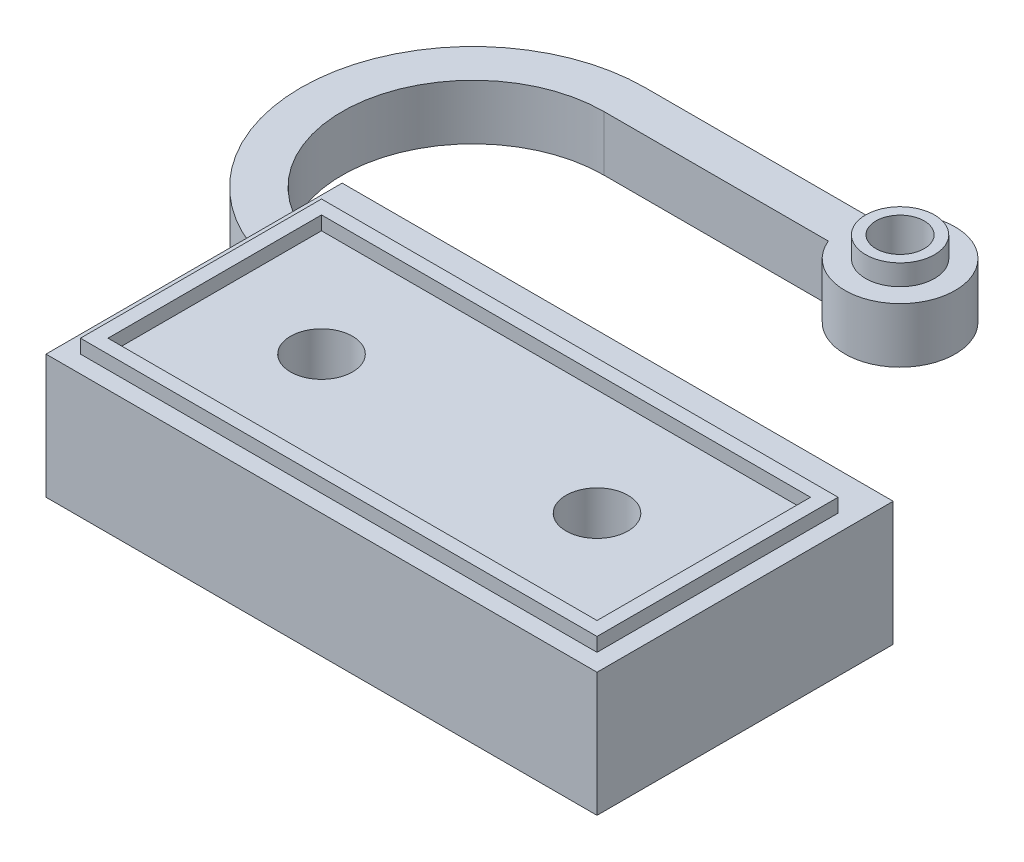
ISO-10303-21;
HEADER;
FILE_DESCRIPTION(('STEP AP214'),'2;1');
FILE_NAME('part.step','',(''),(''),'','','');
FILE_SCHEMA(('AUTOMOTIVE_DESIGN { 1 0 10303 214 1 1 1 1 }'));
ENDSEC;
DATA;
#1=APPLICATION_CONTEXT('core data for automotive mechanical design processes');
#2=APPLICATION_PROTOCOL_DEFINITION('international standard','automotive_design',2000,#1);
#3=PRODUCT_CONTEXT('',#1,'mechanical');
#4=PRODUCT('Part','Part','',(#3));
#5=PRODUCT_RELATED_PRODUCT_CATEGORY('part','',(#4));
#6=PRODUCT_DEFINITION_FORMATION('','',#4);
#7=PRODUCT_DEFINITION_CONTEXT('part definition',#1,'design');
#8=PRODUCT_DEFINITION('design','',#6,#7);
#9=PRODUCT_DEFINITION_SHAPE('','',#8);
#10=(LENGTH_UNIT() NAMED_UNIT(*) SI_UNIT(.MILLI.,.METRE.));
#11=(NAMED_UNIT(*) PLANE_ANGLE_UNIT() SI_UNIT($,.RADIAN.));
#12=(NAMED_UNIT(*) SI_UNIT($,.STERADIAN.) SOLID_ANGLE_UNIT());
#13=UNCERTAINTY_MEASURE_WITH_UNIT(LENGTH_MEASURE(1.E-05),#10,'distance_accuracy_value','');
#14=(GEOMETRIC_REPRESENTATION_CONTEXT(3) GLOBAL_UNCERTAINTY_ASSIGNED_CONTEXT((#13)) GLOBAL_UNIT_ASSIGNED_CONTEXT((#10,
#11,#12)) REPRESENTATION_CONTEXT('',''));
#15=CARTESIAN_POINT('',(0.,0.,0.));
#16=DIRECTION('',(0.,0.,1.));
#17=DIRECTION('',(1.,0.,0.));
#18=AXIS2_PLACEMENT_3D('',#15,#16,#17);
#19=CARTESIAN_POINT('',(0.,9.,0.));
#20=DIRECTION('',(0.,1.,0.));
#21=DIRECTION('',(0.,0.,1.));
#22=AXIS2_PLACEMENT_3D('',#19,#20,#21);
#23=PLANE('',#22);
#24=DIRECTION('',(0.,0.,1.));
#25=VECTOR('',#24,1.);
#26=CARTESIAN_POINT('',(20.,9.,0.));
#27=LINE('',#26,#25);
#28=CARTESIAN_POINT('',(20.,9.,-11.5));
#29=VERTEX_POINT('',#28);
#30=CARTESIAN_POINT('',(20.,9.,10.));
#31=VERTEX_POINT('',#30);
#32=EDGE_CURVE('E306',#29,#31,#27,.T.);
#33=ORIENTED_EDGE('',*,*,#32,.F.);
#34=DIRECTION('',(-1.,0.,0.));
#35=VECTOR('',#34,1.);
#36=CARTESIAN_POINT('',(0.,9.,-11.5));
#37=LINE('',#36,#35);
#38=CARTESIAN_POINT('',(-19.9999999999999,9.,-11.5));
#39=VERTEX_POINT('',#38);
#40=EDGE_CURVE('E309',#29,#39,#37,.T.);
#41=ORIENTED_EDGE('',*,*,#40,.T.);
#42=DIRECTION('',(0.,0.,1.));
#43=VECTOR('',#42,1.);
#44=CARTESIAN_POINT('',(-20.0000000000001,9.,2.98372437868013E-13));
#45=LINE('',#44,#43);
#46=CARTESIAN_POINT('',(-20.,9.,10.));
#47=VERTEX_POINT('',#46);
#48=EDGE_CURVE('E312',#39,#47,#45,.T.);
#49=ORIENTED_EDGE('',*,*,#48,.T.);
#50=DIRECTION('',(1.,0.,0.));
#51=VECTOR('',#50,1.);
#52=CARTESIAN_POINT('',(0.,9.,10.));
#53=LINE('',#52,#51);
#54=EDGE_CURVE('E314',#47,#31,#53,.T.);
#55=ORIENTED_EDGE('',*,*,#54,.T.);
#56=EDGE_LOOP('',(#33,#41,#49,#55));
#57=FACE_BOUND('',#56,.T.);
#58=DIRECTION('',(1.,0.,0.));
#59=VECTOR('',#58,1.);
#60=CARTESIAN_POINT('',(-18.75,9.,8.75));
#61=LINE('',#60,#59);
#62=CARTESIAN_POINT('',(-18.75,9.,8.75));
#63=VERTEX_POINT('',#62);
#64=CARTESIAN_POINT('',(18.75,9.,8.75));
#65=VERTEX_POINT('',#64);
#66=EDGE_CURVE('E74',#63,#65,#61,.T.);
#67=ORIENTED_EDGE('',*,*,#66,.F.);
#68=DIRECTION('',(0.,0.,1.));
#69=VECTOR('',#68,1.);
#70=CARTESIAN_POINT('',(-18.75,9.,-8.75));
#71=LINE('',#70,#69);
#72=CARTESIAN_POINT('',(-18.75,9.,-8.75));
#73=VERTEX_POINT('',#72);
#74=EDGE_CURVE('E200',#73,#63,#71,.T.);
#75=ORIENTED_EDGE('',*,*,#74,.F.);
#76=DIRECTION('',(1.,0.,0.));
#77=VECTOR('',#76,1.);
#78=CARTESIAN_POINT('',(-18.75,9.,-8.75));
#79=LINE('',#78,#77);
#80=CARTESIAN_POINT('',(18.75,9.,-8.75));
#81=VERTEX_POINT('',#80);
#82=EDGE_CURVE('E226',#73,#81,#79,.T.);
#83=ORIENTED_EDGE('',*,*,#82,.T.);
#84=DIRECTION('',(0.,0.,1.));
#85=VECTOR('',#84,1.);
#86=CARTESIAN_POINT('',(18.75,9.,-8.75));
#87=LINE('',#86,#85);
#88=EDGE_CURVE('E79',#81,#65,#87,.T.);
#89=ORIENTED_EDGE('',*,*,#88,.T.);
#90=EDGE_LOOP('',(#67,#75,#83,#89));
#91=FACE_BOUND('',#90,.T.);
#92=ADVANCED_FACE('F59',(#57,#91),#23,.T.);
#93=CARTESIAN_POINT('',(0.,4.,0.));
#94=DIRECTION('',(0.,1.,0.));
#95=DIRECTION('',(0.,0.,1.));
#96=AXIS2_PLACEMENT_3D('',#93,#94,#95);
#97=PLANE('',#96);
#98=DIRECTION('',(1.,0.,0.));
#99=VECTOR('',#98,1.);
#100=CARTESIAN_POINT('',(0.,4.,-30.5));
#101=LINE('',#100,#99);
#102=CARTESIAN_POINT('',(-20.,4.,-30.5));
#103=VERTEX_POINT('',#102);
#104=CARTESIAN_POINT('',(-3.70809924354783,4.,-30.5));
#105=VERTEX_POINT('',#104);
#106=EDGE_CURVE('E259',#103,#105,#101,.T.);
#107=ORIENTED_EDGE('',*,*,#106,.T.);
#108=CARTESIAN_POINT('',(0.,4.,-32.));
#109=DIRECTION('',(0.,1.,0.));
#110=DIRECTION('',(0.,0.,1.));
#111=AXIS2_PLACEMENT_3D('',#108,#109,#110);
#112=CIRCLE('',#111,4.);
#113=CARTESIAN_POINT('',(-3.70809924354783,4.,-33.5));
#114=VERTEX_POINT('',#113);
#115=EDGE_CURVE('E262',#105,#114,#112,.T.);
#116=ORIENTED_EDGE('',*,*,#115,.T.);
#117=DIRECTION('',(-1.,0.,0.));
#118=VECTOR('',#117,1.);
#119=CARTESIAN_POINT('',(0.,4.,-33.5));
#120=LINE('',#119,#118);
#121=CARTESIAN_POINT('',(-20.,4.,-33.5));
#122=VERTEX_POINT('',#121);
#123=EDGE_CURVE('E265',#114,#122,#120,.T.);
#124=ORIENTED_EDGE('',*,*,#123,.T.);
#125=CARTESIAN_POINT('',(-20.,4.,-21.));
#126=DIRECTION('',(0.,1.,0.));
#127=DIRECTION('',(0.,0.,1.));
#128=AXIS2_PLACEMENT_3D('',#125,#126,#127);
#129=CIRCLE('',#128,12.5);
#130=CARTESIAN_POINT('',(-20.0000000000003,4.,-8.5));
#131=VERTEX_POINT('',#130);
#132=EDGE_CURVE('E267',#122,#131,#129,.T.);
#133=ORIENTED_EDGE('',*,*,#132,.T.);
#134=DIRECTION('',(0.,0.,1.));
#135=VECTOR('',#134,1.);
#136=CARTESIAN_POINT('',(-20.0000000000001,4.,2.98372437868013E-13));
#137=LINE('',#136,#135);
#138=CARTESIAN_POINT('',(-19.9999999999999,4.,-11.5));
#139=VERTEX_POINT('',#138);
#140=EDGE_CURVE('E270',#139,#131,#137,.T.);
#141=ORIENTED_EDGE('',*,*,#140,.F.);
#142=CARTESIAN_POINT('',(-20.,4.,-21.));
#143=DIRECTION('',(0.,1.,0.));
#144=DIRECTION('',(0.,0.,1.));
#145=AXIS2_PLACEMENT_3D('',#142,#143,#144);
#146=CIRCLE('',#145,9.49999999999999);
#147=EDGE_CURVE('E272',#139,#103,#146,.F.);
#148=ORIENTED_EDGE('',*,*,#147,.T.);
#149=EDGE_LOOP('',(#107,#116,#124,#133,#141,#148));
#150=FACE_BOUND('',#149,.T.);
#151=CARTESIAN_POINT('',(0.,4.,-32.));
#152=DIRECTION('',(0.,1.,0.));
#153=DIRECTION('',(0.,0.,1.));
#154=AXIS2_PLACEMENT_3D('',#151,#152,#153);
#155=CIRCLE('',#154,2.5);
#156=CARTESIAN_POINT('',(0.,4.,-29.5));
#157=VERTEX_POINT('',#156);
#158=EDGE_CURVE('E252',#157,#157,#155,.T.);
#159=ORIENTED_EDGE('',*,*,#158,.F.);
#160=EDGE_LOOP('',(#159));
#161=FACE_BOUND('',#160,.T.);
#162=ADVANCED_FACE('F356',(#150,#161),#97,.T.);
#163=CARTESIAN_POINT('',(-20.0000000000001,9.,2.98372437868013E-13));
#164=DIRECTION('',(1.,0.,0.));
#165=DIRECTION('',(0.,0.,-1.));
#166=AXIS2_PLACEMENT_3D('',#163,#164,#165);
#167=PLANE('',#166);
#168=DIRECTION('',(0.,-1.,0.));
#169=VECTOR('',#168,1.);
#170=CARTESIAN_POINT('',(-20.0000000000003,4.,-8.5));
#171=LINE('',#170,#169);
#172=CARTESIAN_POINT('',(-20.0000000000003,0.,-8.5));
#173=VERTEX_POINT('',#172);
#174=EDGE_CURVE('E293',#131,#173,#171,.T.);
#175=ORIENTED_EDGE('',*,*,#174,.T.);
#176=DIRECTION('',(0.,0.,1.));
#177=VECTOR('',#176,1.);
#178=CARTESIAN_POINT('',(-20.0000000000001,0.,2.98372437868013E-13));
#179=LINE('',#178,#177);
#180=CARTESIAN_POINT('',(-20.,0.,10.));
#181=VERTEX_POINT('',#180);
#182=EDGE_CURVE('E327',#173,#181,#179,.T.);
#183=ORIENTED_EDGE('',*,*,#182,.T.);
#184=DIRECTION('',(0.,-1.,0.));
#185=VECTOR('',#184,1.);
#186=CARTESIAN_POINT('',(-20.,9.,10.));
#187=LINE('',#186,#185);
#188=EDGE_CURVE('E338',#47,#181,#187,.T.);
#189=ORIENTED_EDGE('',*,*,#188,.F.);
#190=ORIENTED_EDGE('',*,*,#48,.F.);
#191=DIRECTION('',(0.,-1.,0.));
#192=VECTOR('',#191,1.);
#193=CARTESIAN_POINT('',(-19.9999999999999,9.,-11.5));
#194=LINE('',#193,#192);
#195=EDGE_CURVE('E67',#39,#139,#194,.T.);
#196=ORIENTED_EDGE('',*,*,#195,.T.);
#197=ORIENTED_EDGE('',*,*,#140,.T.);
#198=EDGE_LOOP('',(#175,#183,#189,#190,#196,#197));
#199=FACE_BOUND('',#198,.T.);
#200=ADVANCED_FACE('F345',(#199),#167,.F.);
#201=CARTESIAN_POINT('',(20.,9.,0.));
#202=DIRECTION('',(1.,0.,0.));
#203=DIRECTION('',(0.,0.,-1.));
#204=AXIS2_PLACEMENT_3D('',#201,#202,#203);
#205=PLANE('',#204);
#206=DIRECTION('',(0.,0.,1.));
#207=VECTOR('',#206,1.);
#208=CARTESIAN_POINT('',(20.,0.,0.));
#209=LINE('',#208,#207);
#210=CARTESIAN_POINT('',(20.,0.,-11.5));
#211=VERTEX_POINT('',#210);
#212=CARTESIAN_POINT('',(20.,0.,10.));
#213=VERTEX_POINT('',#212);
#214=EDGE_CURVE('E305',#211,#213,#209,.T.);
#215=ORIENTED_EDGE('',*,*,#214,.F.);
#216=DIRECTION('',(0.,-1.,0.));
#217=VECTOR('',#216,1.);
#218=CARTESIAN_POINT('',(20.,9.,-11.5));
#219=LINE('',#218,#217);
#220=EDGE_CURVE('E12',#29,#211,#219,.T.);
#221=ORIENTED_EDGE('',*,*,#220,.F.);
#222=ORIENTED_EDGE('',*,*,#32,.T.);
#223=DIRECTION('',(0.,-1.,0.));
#224=VECTOR('',#223,1.);
#225=CARTESIAN_POINT('',(20.,9.,10.));
#226=LINE('',#225,#224);
#227=EDGE_CURVE('E322',#31,#213,#226,.T.);
#228=ORIENTED_EDGE('',*,*,#227,.T.);
#229=EDGE_LOOP('',(#215,#221,#222,#228));
#230=FACE_BOUND('',#229,.T.);
#231=ADVANCED_FACE('F61',(#230),#205,.T.);
#232=CARTESIAN_POINT('',(0.,9.,-11.5));
#233=DIRECTION('',(0.,0.,1.));
#234=DIRECTION('',(1.,0.,0.));
#235=AXIS2_PLACEMENT_3D('',#232,#233,#234);
#236=PLANE('',#235);
#237=DIRECTION('',(-1.,0.,0.));
#238=VECTOR('',#237,1.);
#239=CARTESIAN_POINT('',(0.,0.,-11.5));
#240=LINE('',#239,#238);
#241=CARTESIAN_POINT('',(-19.9999999999999,0.,-11.5));
#242=VERTEX_POINT('',#241);
#243=EDGE_CURVE('E325',#211,#242,#240,.T.);
#244=ORIENTED_EDGE('',*,*,#243,.T.);
#245=DIRECTION('',(0.,-1.,0.));
#246=VECTOR('',#245,1.);
#247=CARTESIAN_POINT('',(-19.9999999999999,4.,-11.5));
#248=LINE('',#247,#246);
#249=EDGE_CURVE('E290',#139,#242,#248,.T.);
#250=ORIENTED_EDGE('',*,*,#249,.F.);
#251=ORIENTED_EDGE('',*,*,#195,.F.);
#252=ORIENTED_EDGE('',*,*,#40,.F.);
#253=ORIENTED_EDGE('',*,*,#220,.T.);
#254=EDGE_LOOP('',(#244,#250,#251,#252,#253));
#255=FACE_BOUND('',#254,.T.);
#256=ADVANCED_FACE('F378',(#255),#236,.F.);
#257=CARTESIAN_POINT('',(-10.,9.,0.));
#258=DIRECTION('',(0.,-1.,0.));
#259=DIRECTION('',(0.,0.,-1.));
#260=AXIS2_PLACEMENT_3D('',#257,#258,#259);
#261=CYLINDRICAL_SURFACE('',#260,2.25);
#262=CARTESIAN_POINT('',(-10.,9.,0.));
#263=DIRECTION('',(0.,1.,0.));
#264=DIRECTION('',(0.,0.,1.));
#265=AXIS2_PLACEMENT_3D('',#262,#263,#264);
#266=CIRCLE('',#265,2.25);
#267=CARTESIAN_POINT('',(-10.,9.,2.25));
#268=VERTEX_POINT('',#267);
#269=EDGE_CURVE('E316',#268,#268,#266,.T.);
#270=ORIENTED_EDGE('',*,*,#269,.T.);
#271=EDGE_LOOP('',(#270));
#272=FACE_BOUND('',#271,.T.);
#273=CARTESIAN_POINT('',(-10.,0.,0.));
#274=DIRECTION('',(0.,1.,0.));
#275=DIRECTION('',(0.,0.,1.));
#276=AXIS2_PLACEMENT_3D('',#273,#274,#275);
#277=CIRCLE('',#276,2.25);
#278=CARTESIAN_POINT('',(-10.,0.,2.25));
#279=VERTEX_POINT('',#278);
#280=EDGE_CURVE('E332',#279,#279,#277,.T.);
#281=ORIENTED_EDGE('',*,*,#280,.F.);
#282=EDGE_LOOP('',(#281));
#283=FACE_BOUND('',#282,.T.);
#284=ADVANCED_FACE('F380',(#272,#283),#261,.F.);
#285=CARTESIAN_POINT('',(0.,9.,10.));
#286=DIRECTION('',(0.,0.,-1.));
#287=DIRECTION('',(-1.,0.,0.));
#288=AXIS2_PLACEMENT_3D('',#285,#286,#287);
#289=PLANE('',#288);
#290=DIRECTION('',(1.,0.,0.));
#291=VECTOR('',#290,1.);
#292=CARTESIAN_POINT('',(0.,0.,10.));
#293=LINE('',#292,#291);
#294=EDGE_CURVE('E329',#181,#213,#293,.T.);
#295=ORIENTED_EDGE('',*,*,#294,.T.);
#296=ORIENTED_EDGE('',*,*,#227,.F.);
#297=ORIENTED_EDGE('',*,*,#54,.F.);
#298=ORIENTED_EDGE('',*,*,#188,.T.);
#299=EDGE_LOOP('',(#295,#296,#297,#298));
#300=FACE_BOUND('',#299,.T.);
#301=ADVANCED_FACE('F369',(#300),#289,.F.);
#302=CARTESIAN_POINT('',(10.,9.,0.));
#303=DIRECTION('',(0.,-1.,0.));
#304=DIRECTION('',(0.,0.,-1.));
#305=AXIS2_PLACEMENT_3D('',#302,#303,#304);
#306=CYLINDRICAL_SURFACE('',#305,2.25);
#307=CARTESIAN_POINT('',(10.,9.,0.));
#308=DIRECTION('',(0.,1.,0.));
#309=DIRECTION('',(0.,0.,1.));
#310=AXIS2_PLACEMENT_3D('',#307,#308,#309);
#311=CIRCLE('',#310,2.25);
#312=CARTESIAN_POINT('',(10.,9.,2.25));
#313=VERTEX_POINT('',#312);
#314=EDGE_CURVE('E319',#313,#313,#311,.F.);
#315=ORIENTED_EDGE('',*,*,#314,.F.);
#316=EDGE_LOOP('',(#315));
#317=FACE_BOUND('',#316,.T.);
#318=CARTESIAN_POINT('',(10.,0.,0.));
#319=DIRECTION('',(0.,1.,0.));
#320=DIRECTION('',(0.,0.,1.));
#321=AXIS2_PLACEMENT_3D('',#318,#319,#320);
#322=CIRCLE('',#321,2.25);
#323=CARTESIAN_POINT('',(10.,0.,2.25));
#324=VERTEX_POINT('',#323);
#325=EDGE_CURVE('E310',#324,#324,#322,.F.);
#326=ORIENTED_EDGE('',*,*,#325,.T.);
#327=EDGE_LOOP('',(#326));
#328=FACE_BOUND('',#327,.T.);
#329=ADVANCED_FACE('F398',(#317,#328),#306,.F.);
#330=DIRECTION('',(1.,0.,0.));
#331=VECTOR('',#330,1.);
#332=CARTESIAN_POINT('',(-17.75,9.,7.75));
#333=LINE('',#332,#331);
#334=CARTESIAN_POINT('',(-17.75,9.,7.75));
#335=VERTEX_POINT('',#334);
#336=CARTESIAN_POINT('',(17.75,9.,7.75));
#337=VERTEX_POINT('',#336);
#338=EDGE_CURVE('E210',#335,#337,#333,.T.);
#339=ORIENTED_EDGE('',*,*,#338,.T.);
#340=DIRECTION('',(0.,0.,1.));
#341=VECTOR('',#340,1.);
#342=CARTESIAN_POINT('',(17.75,9.,-7.75));
#343=LINE('',#342,#341);
#344=CARTESIAN_POINT('',(17.75,9.,-7.75));
#345=VERTEX_POINT('',#344);
#346=EDGE_CURVE('E199',#345,#337,#343,.T.);
#347=ORIENTED_EDGE('',*,*,#346,.F.);
#348=DIRECTION('',(1.,0.,0.));
#349=VECTOR('',#348,1.);
#350=CARTESIAN_POINT('',(-17.75,9.,-7.75));
#351=LINE('',#350,#349);
#352=CARTESIAN_POINT('',(-17.75,9.,-7.75));
#353=VERTEX_POINT('',#352);
#354=EDGE_CURVE('E213',#353,#345,#351,.T.);
#355=ORIENTED_EDGE('',*,*,#354,.F.);
#356=DIRECTION('',(0.,0.,1.));
#357=VECTOR('',#356,1.);
#358=CARTESIAN_POINT('',(-17.75,9.,-7.75));
#359=LINE('',#358,#357);
#360=EDGE_CURVE('E192',#353,#335,#359,.T.);
#361=ORIENTED_EDGE('',*,*,#360,.T.);
#362=EDGE_LOOP('',(#339,#347,#355,#361));
#363=FACE_BOUND('',#362,.T.);
#364=ORIENTED_EDGE('',*,*,#269,.F.);
#365=EDGE_LOOP('',(#364));
#366=FACE_BOUND('',#365,.T.);
#367=ORIENTED_EDGE('',*,*,#314,.T.);
#368=EDGE_LOOP('',(#367));
#369=FACE_BOUND('',#368,.T.);
#370=ADVANCED_FACE('F390',(#363,#366,#369),#23,.T.);
#371=CARTESIAN_POINT('',(0.,0.,0.));
#372=DIRECTION('',(0.,1.,0.));
#373=DIRECTION('',(0.,0.,1.));
#374=AXIS2_PLACEMENT_3D('',#371,#372,#373);
#375=PLANE('',#374);
#376=ORIENTED_EDGE('',*,*,#214,.T.);
#377=ORIENTED_EDGE('',*,*,#294,.F.);
#378=ORIENTED_EDGE('',*,*,#182,.F.);
#379=CARTESIAN_POINT('',(-20.,0.,-21.));
#380=DIRECTION('',(0.,1.,0.));
#381=DIRECTION('',(0.,0.,1.));
#382=AXIS2_PLACEMENT_3D('',#379,#380,#381);
#383=CIRCLE('',#382,12.5);
#384=CARTESIAN_POINT('',(-20.,0.,-33.5));
#385=VERTEX_POINT('',#384);
#386=EDGE_CURVE('E284',#385,#173,#383,.T.);
#387=ORIENTED_EDGE('',*,*,#386,.F.);
#388=DIRECTION('',(-1.,0.,0.));
#389=VECTOR('',#388,1.);
#390=CARTESIAN_POINT('',(0.,0.,-33.5));
#391=LINE('',#390,#389);
#392=CARTESIAN_POINT('',(-3.70809924354783,0.,-33.5));
#393=VERTEX_POINT('',#392);
#394=EDGE_CURVE('E282',#393,#385,#391,.T.);
#395=ORIENTED_EDGE('',*,*,#394,.F.);
#396=CARTESIAN_POINT('',(0.,0.,-32.));
#397=DIRECTION('',(0.,1.,0.));
#398=DIRECTION('',(0.,0.,1.));
#399=AXIS2_PLACEMENT_3D('',#396,#397,#398);
#400=CIRCLE('',#399,4.);
#401=CARTESIAN_POINT('',(-3.70809924354783,0.,-30.5));
#402=VERTEX_POINT('',#401);
#403=EDGE_CURVE('E280',#402,#393,#400,.T.);
#404=ORIENTED_EDGE('',*,*,#403,.F.);
#405=DIRECTION('',(1.,0.,0.));
#406=VECTOR('',#405,1.);
#407=CARTESIAN_POINT('',(0.,0.,-30.5));
#408=LINE('',#407,#406);
#409=CARTESIAN_POINT('',(-20.,0.,-30.5));
#410=VERTEX_POINT('',#409);
#411=EDGE_CURVE('E277',#410,#402,#408,.T.);
#412=ORIENTED_EDGE('',*,*,#411,.F.);
#413=CARTESIAN_POINT('',(-20.,0.,-21.));
#414=DIRECTION('',(0.,1.,0.));
#415=DIRECTION('',(0.,0.,1.));
#416=AXIS2_PLACEMENT_3D('',#413,#414,#415);
#417=CIRCLE('',#416,9.49999999999999);
#418=EDGE_CURVE('E263',#242,#410,#417,.F.);
#419=ORIENTED_EDGE('',*,*,#418,.F.);
#420=ORIENTED_EDGE('',*,*,#243,.F.);
#421=EDGE_LOOP('',(#376,#377,#378,#387,#395,#404,#412,#419,#420));
#422=FACE_BOUND('',#421,.T.);
#423=ORIENTED_EDGE('',*,*,#280,.T.);
#424=EDGE_LOOP('',(#423));
#425=FACE_BOUND('',#424,.T.);
#426=ORIENTED_EDGE('',*,*,#325,.F.);
#427=EDGE_LOOP('',(#426));
#428=FACE_BOUND('',#427,.T.);
#429=CARTESIAN_POINT('',(0.,0.,-32.));
#430=DIRECTION('',(0.,1.,0.));
#431=DIRECTION('',(0.,0.,1.));
#432=AXIS2_PLACEMENT_3D('',#429,#430,#431);
#433=CIRCLE('',#432,1.75);
#434=CARTESIAN_POINT('',(0.,0.,-30.25));
#435=VERTEX_POINT('',#434);
#436=EDGE_CURVE('E256',#435,#435,#433,.T.);
#437=ORIENTED_EDGE('',*,*,#436,.T.);
#438=EDGE_LOOP('',(#437));
#439=FACE_BOUND('',#438,.T.);
#440=ADVANCED_FACE('F371',(#422,#425,#428,#439),#375,.F.);
#441=CARTESIAN_POINT('',(0.,4.,-30.5));
#442=DIRECTION('',(0.,0.,-1.));
#443=DIRECTION('',(-1.,0.,0.));
#444=AXIS2_PLACEMENT_3D('',#441,#442,#443);
#445=PLANE('',#444);
#446=ORIENTED_EDGE('',*,*,#411,.T.);
#447=DIRECTION('',(0.,-1.,0.));
#448=VECTOR('',#447,1.);
#449=CARTESIAN_POINT('',(-3.70809924354783,4.,-30.5));
#450=LINE('',#449,#448);
#451=EDGE_CURVE('E302',#105,#402,#450,.T.);
#452=ORIENTED_EDGE('',*,*,#451,.F.);
#453=ORIENTED_EDGE('',*,*,#106,.F.);
#454=DIRECTION('',(0.,-1.,0.));
#455=VECTOR('',#454,1.);
#456=CARTESIAN_POINT('',(-20.,4.,-30.5));
#457=LINE('',#456,#455);
#458=EDGE_CURVE('E274',#103,#410,#457,.T.);
#459=ORIENTED_EDGE('',*,*,#458,.T.);
#460=EDGE_LOOP('',(#446,#452,#453,#459));
#461=FACE_BOUND('',#460,.T.);
#462=ADVANCED_FACE('F404',(#461),#445,.F.);
#463=CARTESIAN_POINT('',(0.,4.,-32.));
#464=DIRECTION('',(0.,-1.,0.));
#465=DIRECTION('',(0.,0.,-1.));
#466=AXIS2_PLACEMENT_3D('',#463,#464,#465);
#467=CYLINDRICAL_SURFACE('',#466,4.);
#468=ORIENTED_EDGE('',*,*,#403,.T.);
#469=DIRECTION('',(0.,-1.,0.));
#470=VECTOR('',#469,1.);
#471=CARTESIAN_POINT('',(-3.70809924354783,4.,-33.5));
#472=LINE('',#471,#470);
#473=EDGE_CURVE('E299',#114,#393,#472,.T.);
#474=ORIENTED_EDGE('',*,*,#473,.F.);
#475=ORIENTED_EDGE('',*,*,#115,.F.);
#476=ORIENTED_EDGE('',*,*,#451,.T.);
#477=EDGE_LOOP('',(#468,#474,#475,#476));
#478=FACE_BOUND('',#477,.T.);
#479=ADVANCED_FACE('F443',(#478),#467,.T.);
#480=CARTESIAN_POINT('',(0.,4.,-33.5));
#481=DIRECTION('',(0.,0.,1.));
#482=DIRECTION('',(1.,0.,0.));
#483=AXIS2_PLACEMENT_3D('',#480,#481,#482);
#484=PLANE('',#483);
#485=ORIENTED_EDGE('',*,*,#394,.T.);
#486=DIRECTION('',(0.,-1.,0.));
#487=VECTOR('',#486,1.);
#488=CARTESIAN_POINT('',(-20.,4.,-33.5));
#489=LINE('',#488,#487);
#490=EDGE_CURVE('E296',#122,#385,#489,.T.);
#491=ORIENTED_EDGE('',*,*,#490,.F.);
#492=ORIENTED_EDGE('',*,*,#123,.F.);
#493=ORIENTED_EDGE('',*,*,#473,.T.);
#494=EDGE_LOOP('',(#485,#491,#492,#493));
#495=FACE_BOUND('',#494,.T.);
#496=ADVANCED_FACE('F440',(#495),#484,.F.);
#497=CARTESIAN_POINT('',(-20.,4.,-21.));
#498=DIRECTION('',(0.,-1.,0.));
#499=DIRECTION('',(0.,0.,-1.));
#500=AXIS2_PLACEMENT_3D('',#497,#498,#499);
#501=CYLINDRICAL_SURFACE('',#500,12.5);
#502=ORIENTED_EDGE('',*,*,#386,.T.);
#503=ORIENTED_EDGE('',*,*,#174,.F.);
#504=ORIENTED_EDGE('',*,*,#132,.F.);
#505=ORIENTED_EDGE('',*,*,#490,.T.);
#506=EDGE_LOOP('',(#502,#503,#504,#505));
#507=FACE_BOUND('',#506,.T.);
#508=ADVANCED_FACE('F363',(#507),#501,.T.);
#509=CARTESIAN_POINT('',(0.,4.,-32.));
#510=DIRECTION('',(0.,-1.,0.));
#511=DIRECTION('',(0.,0.,-1.));
#512=AXIS2_PLACEMENT_3D('',#509,#510,#511);
#513=CYLINDRICAL_SURFACE('',#512,1.75);
#514=ORIENTED_EDGE('',*,*,#436,.F.);
#515=EDGE_LOOP('',(#514));
#516=FACE_BOUND('',#515,.T.);
#517=CARTESIAN_POINT('',(0.,5.5,-32.));
#518=DIRECTION('',(0.,1.,0.));
#519=DIRECTION('',(0.,0.,1.));
#520=AXIS2_PLACEMENT_3D('',#517,#518,#519);
#521=CIRCLE('',#520,1.75);
#522=CARTESIAN_POINT('',(0.,5.5,-30.25));
#523=VERTEX_POINT('',#522);
#524=EDGE_CURVE('E249',#523,#523,#521,.T.);
#525=ORIENTED_EDGE('',*,*,#524,.T.);
#526=EDGE_LOOP('',(#525));
#527=FACE_BOUND('',#526,.T.);
#528=ADVANCED_FACE('F417',(#516,#527),#513,.F.);
#529=CARTESIAN_POINT('',(-20.,4.,-21.));
#530=DIRECTION('',(0.,-1.,0.));
#531=DIRECTION('',(0.,0.,-1.));
#532=AXIS2_PLACEMENT_3D('',#529,#530,#531);
#533=CYLINDRICAL_SURFACE('',#532,9.49999999999999);
#534=ORIENTED_EDGE('',*,*,#418,.T.);
#535=ORIENTED_EDGE('',*,*,#458,.F.);
#536=ORIENTED_EDGE('',*,*,#147,.F.);
#537=ORIENTED_EDGE('',*,*,#249,.T.);
#538=EDGE_LOOP('',(#534,#535,#536,#537));
#539=FACE_BOUND('',#538,.T.);
#540=ADVANCED_FACE('F352',(#539),#533,.F.);
#541=CARTESIAN_POINT('',(0.,5.5,-32.));
#542=DIRECTION('',(0.,1.,0.));
#543=DIRECTION('',(0.,0.,1.));
#544=AXIS2_PLACEMENT_3D('',#541,#542,#543);
#545=PLANE('',#544);
#546=CARTESIAN_POINT('',(0.,5.5,-32.));
#547=DIRECTION('',(0.,1.,0.));
#548=DIRECTION('',(0.,0.,1.));
#549=AXIS2_PLACEMENT_3D('',#546,#547,#548);
#550=CIRCLE('',#549,2.5);
#551=CARTESIAN_POINT('',(0.,5.5,-29.5));
#552=VERTEX_POINT('',#551);
#553=EDGE_CURVE('E253',#552,#552,#550,.T.);
#554=ORIENTED_EDGE('',*,*,#553,.T.);
#555=EDGE_LOOP('',(#554));
#556=FACE_BOUND('',#555,.T.);
#557=ORIENTED_EDGE('',*,*,#524,.F.);
#558=EDGE_LOOP('',(#557));
#559=FACE_BOUND('',#558,.T.);
#560=ADVANCED_FACE('F422',(#556,#559),#545,.T.);
#561=CARTESIAN_POINT('',(0.,5.5,-32.));
#562=DIRECTION('',(0.,-1.,0.));
#563=DIRECTION('',(0.,0.,-1.));
#564=AXIS2_PLACEMENT_3D('',#561,#562,#563);
#565=CYLINDRICAL_SURFACE('',#564,2.5);
#566=ORIENTED_EDGE('',*,*,#553,.F.);
#567=EDGE_LOOP('',(#566));
#568=FACE_BOUND('',#567,.T.);
#569=ORIENTED_EDGE('',*,*,#158,.T.);
#570=EDGE_LOOP('',(#569));
#571=FACE_BOUND('',#570,.T.);
#572=ADVANCED_FACE('F424',(#568,#571),#565,.T.);
#573=CARTESIAN_POINT('',(0.,10.,0.));
#574=DIRECTION('',(0.,1.,0.));
#575=DIRECTION('',(0.,0.,1.));
#576=AXIS2_PLACEMENT_3D('',#573,#574,#575);
#577=PLANE('',#576);
#578=DIRECTION('',(0.,0.,1.));
#579=VECTOR('',#578,1.);
#580=CARTESIAN_POINT('',(-18.75,10.,-8.75));
#581=LINE('',#580,#579);
#582=CARTESIAN_POINT('',(-18.75,10.,-8.75));
#583=VERTEX_POINT('',#582);
#584=CARTESIAN_POINT('',(-18.75,10.,8.75));
#585=VERTEX_POINT('',#584);
#586=EDGE_CURVE('E222',#583,#585,#581,.T.);
#587=ORIENTED_EDGE('',*,*,#586,.T.);
#588=DIRECTION('',(1.,0.,0.));
#589=VECTOR('',#588,1.);
#590=CARTESIAN_POINT('',(-18.75,10.,8.75));
#591=LINE('',#590,#589);
#592=CARTESIAN_POINT('',(18.75,10.,8.75));
#593=VERTEX_POINT('',#592);
#594=EDGE_CURVE('E225',#585,#593,#591,.T.);
#595=ORIENTED_EDGE('',*,*,#594,.T.);
#596=DIRECTION('',(0.,0.,1.));
#597=VECTOR('',#596,1.);
#598=CARTESIAN_POINT('',(18.75,10.,-8.75));
#599=LINE('',#598,#597);
#600=CARTESIAN_POINT('',(18.75,10.,-8.75));
#601=VERTEX_POINT('',#600);
#602=EDGE_CURVE('E228',#601,#593,#599,.T.);
#603=ORIENTED_EDGE('',*,*,#602,.F.);
#604=DIRECTION('',(1.,0.,0.));
#605=VECTOR('',#604,1.);
#606=CARTESIAN_POINT('',(-18.75,10.,-8.75));
#607=LINE('',#606,#605);
#608=EDGE_CURVE('E231',#583,#601,#607,.T.);
#609=ORIENTED_EDGE('',*,*,#608,.F.);
#610=EDGE_LOOP('',(#587,#595,#603,#609));
#611=FACE_BOUND('',#610,.T.);
#612=DIRECTION('',(0.,0.,1.));
#613=VECTOR('',#612,1.);
#614=CARTESIAN_POINT('',(17.75,10.,-7.75));
#615=LINE('',#614,#613);
#616=CARTESIAN_POINT('',(17.75,10.,-7.75));
#617=VERTEX_POINT('',#616);
#618=CARTESIAN_POINT('',(17.75,10.,7.75));
#619=VERTEX_POINT('',#618);
#620=EDGE_CURVE('E191',#617,#619,#615,.T.);
#621=ORIENTED_EDGE('',*,*,#620,.T.);
#622=DIRECTION('',(1.,0.,0.));
#623=VECTOR('',#622,1.);
#624=CARTESIAN_POINT('',(-17.75,10.,7.75));
#625=LINE('',#624,#623);
#626=CARTESIAN_POINT('',(-17.75,10.,7.75));
#627=VERTEX_POINT('',#626);
#628=EDGE_CURVE('E180',#627,#619,#625,.T.);
#629=ORIENTED_EDGE('',*,*,#628,.F.);
#630=DIRECTION('',(0.,0.,1.));
#631=VECTOR('',#630,1.);
#632=CARTESIAN_POINT('',(-17.75,10.,-7.75));
#633=LINE('',#632,#631);
#634=CARTESIAN_POINT('',(-17.75,10.,-7.75));
#635=VERTEX_POINT('',#634);
#636=EDGE_CURVE('E206',#635,#627,#633,.T.);
#637=ORIENTED_EDGE('',*,*,#636,.F.);
#638=DIRECTION('',(1.,0.,0.));
#639=VECTOR('',#638,1.);
#640=CARTESIAN_POINT('',(-17.75,10.,-7.75));
#641=LINE('',#640,#639);
#642=EDGE_CURVE('E204',#635,#617,#641,.T.);
#643=ORIENTED_EDGE('',*,*,#642,.T.);
#644=EDGE_LOOP('',(#621,#629,#637,#643));
#645=FACE_BOUND('',#644,.T.);
#646=ADVANCED_FACE('F203',(#611,#645),#577,.T.);
#647=CARTESIAN_POINT('',(-18.75,10.,-8.75));
#648=DIRECTION('',(1.,0.,0.));
#649=DIRECTION('',(0.,0.,-1.));
#650=AXIS2_PLACEMENT_3D('',#647,#648,#649);
#651=PLANE('',#650);
#652=ORIENTED_EDGE('',*,*,#74,.T.);
#653=DIRECTION('',(0.,-1.,0.));
#654=VECTOR('',#653,1.);
#655=CARTESIAN_POINT('',(-18.75,10.,8.75));
#656=LINE('',#655,#654);
#657=EDGE_CURVE('E247',#585,#63,#656,.T.);
#658=ORIENTED_EDGE('',*,*,#657,.F.);
#659=ORIENTED_EDGE('',*,*,#586,.F.);
#660=DIRECTION('',(0.,-1.,0.));
#661=VECTOR('',#660,1.);
#662=CARTESIAN_POINT('',(-18.75,10.,-8.75));
#663=LINE('',#662,#661);
#664=EDGE_CURVE('E234',#583,#73,#663,.T.);
#665=ORIENTED_EDGE('',*,*,#664,.T.);
#666=EDGE_LOOP('',(#652,#658,#659,#665));
#667=FACE_BOUND('',#666,.T.);
#668=ADVANCED_FACE('F435',(#667),#651,.F.);
#669=CARTESIAN_POINT('',(-18.75,10.,8.75));
#670=DIRECTION('',(0.,0.,-1.));
#671=DIRECTION('',(-1.,0.,0.));
#672=AXIS2_PLACEMENT_3D('',#669,#670,#671);
#673=PLANE('',#672);
#674=ORIENTED_EDGE('',*,*,#66,.T.);
#675=DIRECTION('',(0.,-1.,0.));
#676=VECTOR('',#675,1.);
#677=CARTESIAN_POINT('',(18.75,10.,8.75));
#678=LINE('',#677,#676);
#679=EDGE_CURVE('E245',#593,#65,#678,.T.);
#680=ORIENTED_EDGE('',*,*,#679,.F.);
#681=ORIENTED_EDGE('',*,*,#594,.F.);
#682=ORIENTED_EDGE('',*,*,#657,.T.);
#683=EDGE_LOOP('',(#674,#680,#681,#682));
#684=FACE_BOUND('',#683,.T.);
#685=ADVANCED_FACE('F596',(#684),#673,.F.);
#686=CARTESIAN_POINT('',(18.75,10.,-8.75));
#687=DIRECTION('',(1.,0.,0.));
#688=DIRECTION('',(0.,0.,-1.));
#689=AXIS2_PLACEMENT_3D('',#686,#687,#688);
#690=PLANE('',#689);
#691=ORIENTED_EDGE('',*,*,#88,.F.);
#692=DIRECTION('',(0.,-1.,0.));
#693=VECTOR('',#692,1.);
#694=CARTESIAN_POINT('',(18.75,10.,-8.75));
#695=LINE('',#694,#693);
#696=EDGE_CURVE('E242',#601,#81,#695,.T.);
#697=ORIENTED_EDGE('',*,*,#696,.F.);
#698=ORIENTED_EDGE('',*,*,#602,.T.);
#699=ORIENTED_EDGE('',*,*,#679,.T.);
#700=EDGE_LOOP('',(#691,#697,#698,#699));
#701=FACE_BOUND('',#700,.T.);
#702=ADVANCED_FACE('F604',(#701),#690,.T.);
#703=CARTESIAN_POINT('',(-18.75,10.,-8.75));
#704=DIRECTION('',(0.,0.,-1.));
#705=DIRECTION('',(-1.,0.,0.));
#706=AXIS2_PLACEMENT_3D('',#703,#704,#705);
#707=PLANE('',#706);
#708=ORIENTED_EDGE('',*,*,#82,.F.);
#709=ORIENTED_EDGE('',*,*,#664,.F.);
#710=ORIENTED_EDGE('',*,*,#608,.T.);
#711=ORIENTED_EDGE('',*,*,#696,.T.);
#712=EDGE_LOOP('',(#708,#709,#710,#711));
#713=FACE_BOUND('',#712,.T.);
#714=ADVANCED_FACE('F612',(#713),#707,.T.);
#715=CARTESIAN_POINT('',(-17.75,10.,7.75));
#716=DIRECTION('',(0.,0.,-1.));
#717=DIRECTION('',(-1.,0.,0.));
#718=AXIS2_PLACEMENT_3D('',#715,#716,#717);
#719=PLANE('',#718);
#720=ORIENTED_EDGE('',*,*,#338,.F.);
#721=DIRECTION('',(0.,-1.,0.));
#722=VECTOR('',#721,1.);
#723=CARTESIAN_POINT('',(-17.75,10.,7.75));
#724=LINE('',#723,#722);
#725=EDGE_CURVE('E187',#627,#335,#724,.T.);
#726=ORIENTED_EDGE('',*,*,#725,.F.);
#727=ORIENTED_EDGE('',*,*,#628,.T.);
#728=DIRECTION('',(0.,-1.,0.));
#729=VECTOR('',#728,1.);
#730=CARTESIAN_POINT('',(17.75,10.,7.75));
#731=LINE('',#730,#729);
#732=EDGE_CURVE('E184',#619,#337,#731,.T.);
#733=ORIENTED_EDGE('',*,*,#732,.T.);
#734=EDGE_LOOP('',(#720,#726,#727,#733));
#735=FACE_BOUND('',#734,.T.);
#736=ADVANCED_FACE('F183',(#735),#719,.T.);
#737=CARTESIAN_POINT('',(17.75,10.,-7.75));
#738=DIRECTION('',(1.,0.,0.));
#739=DIRECTION('',(0.,0.,-1.));
#740=AXIS2_PLACEMENT_3D('',#737,#738,#739);
#741=PLANE('',#740);
#742=ORIENTED_EDGE('',*,*,#346,.T.);
#743=ORIENTED_EDGE('',*,*,#732,.F.);
#744=ORIENTED_EDGE('',*,*,#620,.F.);
#745=DIRECTION('',(0.,-1.,0.));
#746=VECTOR('',#745,1.);
#747=CARTESIAN_POINT('',(17.75,10.,-7.75));
#748=LINE('',#747,#746);
#749=EDGE_CURVE('E201',#617,#345,#748,.T.);
#750=ORIENTED_EDGE('',*,*,#749,.T.);
#751=EDGE_LOOP('',(#742,#743,#744,#750));
#752=FACE_BOUND('',#751,.T.);
#753=ADVANCED_FACE('F196',(#752),#741,.F.);
#754=CARTESIAN_POINT('',(-17.75,10.,-7.75));
#755=DIRECTION('',(0.,0.,-1.));
#756=DIRECTION('',(-1.,0.,0.));
#757=AXIS2_PLACEMENT_3D('',#754,#755,#756);
#758=PLANE('',#757);
#759=ORIENTED_EDGE('',*,*,#354,.T.);
#760=ORIENTED_EDGE('',*,*,#749,.F.);
#761=ORIENTED_EDGE('',*,*,#642,.F.);
#762=DIRECTION('',(0.,-1.,0.));
#763=VECTOR('',#762,1.);
#764=CARTESIAN_POINT('',(-17.75,10.,-7.75));
#765=LINE('',#764,#763);
#766=EDGE_CURVE('E218',#635,#353,#765,.T.);
#767=ORIENTED_EDGE('',*,*,#766,.T.);
#768=EDGE_LOOP('',(#759,#760,#761,#767));
#769=FACE_BOUND('',#768,.T.);
#770=ADVANCED_FACE('F636',(#769),#758,.F.);
#771=CARTESIAN_POINT('',(-17.75,10.,-7.75));
#772=DIRECTION('',(1.,0.,0.));
#773=DIRECTION('',(0.,0.,-1.));
#774=AXIS2_PLACEMENT_3D('',#771,#772,#773);
#775=PLANE('',#774);
#776=ORIENTED_EDGE('',*,*,#360,.F.);
#777=ORIENTED_EDGE('',*,*,#766,.F.);
#778=ORIENTED_EDGE('',*,*,#636,.T.);
#779=ORIENTED_EDGE('',*,*,#725,.T.);
#780=EDGE_LOOP('',(#776,#777,#778,#779));
#781=FACE_BOUND('',#780,.T.);
#782=ADVANCED_FACE('F644',(#781),#775,.T.);
#783=CLOSED_SHELL('',(#92,#162,#200,#231,#256,#284,#301,#329,#370,#440,#462,#479,#496,#508,#528,
#540,#560,#572,#646,#668,#685,#702,#714,#736,#753,#770,#782));
#784=MANIFOLD_SOLID_BREP('B2',#783);
#785=ADVANCED_BREP_SHAPE_REPRESENTATION('',(#18,#784),#14);
#786=SHAPE_DEFINITION_REPRESENTATION(#9,#785);
ENDSEC;
END-ISO-10303-21;
